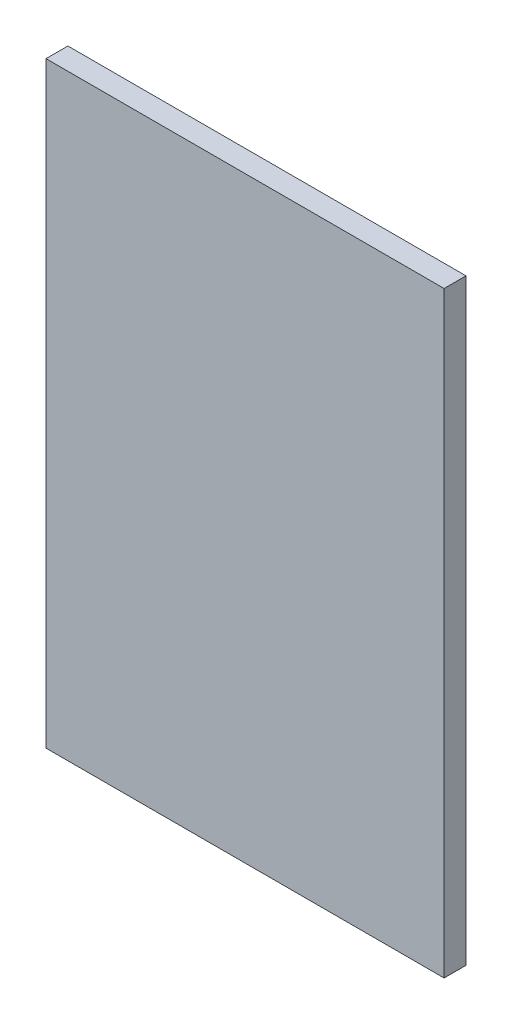
ISO-10303-21;
HEADER;
FILE_DESCRIPTION(('STEP AP214'),'2;1');
FILE_NAME('part.step','',(''),(''),'','','');
FILE_SCHEMA(('AUTOMOTIVE_DESIGN { 1 0 10303 214 1 1 1 1 }'));
ENDSEC;
DATA;
#1=APPLICATION_CONTEXT('core data for automotive mechanical design processes');
#2=APPLICATION_PROTOCOL_DEFINITION('international standard','automotive_design',2000,#1);
#3=PRODUCT_CONTEXT('',#1,'mechanical');
#4=PRODUCT('Part','Part','',(#3));
#5=PRODUCT_RELATED_PRODUCT_CATEGORY('part','',(#4));
#6=PRODUCT_DEFINITION_FORMATION('','',#4);
#7=PRODUCT_DEFINITION_CONTEXT('part definition',#1,'design');
#8=PRODUCT_DEFINITION('design','',#6,#7);
#9=PRODUCT_DEFINITION_SHAPE('','',#8);
#10=(LENGTH_UNIT() NAMED_UNIT(*) SI_UNIT(.MILLI.,.METRE.));
#11=(NAMED_UNIT(*) PLANE_ANGLE_UNIT() SI_UNIT($,.RADIAN.));
#12=(NAMED_UNIT(*) SI_UNIT($,.STERADIAN.) SOLID_ANGLE_UNIT());
#13=UNCERTAINTY_MEASURE_WITH_UNIT(LENGTH_MEASURE(1.E-05),#10,'distance_accuracy_value','');
#14=(GEOMETRIC_REPRESENTATION_CONTEXT(3) GLOBAL_UNCERTAINTY_ASSIGNED_CONTEXT((#13)) GLOBAL_UNIT_ASSIGNED_CONTEXT((#10,
#11,#12)) REPRESENTATION_CONTEXT('',''));
#15=CARTESIAN_POINT('',(0.,0.,0.));
#16=DIRECTION('',(0.,0.,1.));
#17=DIRECTION('',(1.,0.,0.));
#18=AXIS2_PLACEMENT_3D('',#15,#16,#17);
#19=CARTESIAN_POINT('',(10.,-15.,1.1));
#20=DIRECTION('',(-1.,0.,0.));
#21=DIRECTION('',(0.,0.,1.));
#22=AXIS2_PLACEMENT_3D('',#19,#20,#21);
#23=PLANE('',#22);
#24=DIRECTION('',(0.,1.,0.));
#25=VECTOR('',#24,1.);
#26=CARTESIAN_POINT('',(10.,-15.,0.));
#27=LINE('',#26,#25);
#28=CARTESIAN_POINT('',(10.,-15.,0.));
#29=VERTEX_POINT('',#28);
#30=CARTESIAN_POINT('',(10.,15.,0.));
#31=VERTEX_POINT('',#30);
#32=EDGE_CURVE('E96',#29,#31,#27,.T.);
#33=ORIENTED_EDGE('',*,*,#32,.T.);
#34=DIRECTION('',(0.,0.,-1.));
#35=VECTOR('',#34,1.);
#36=CARTESIAN_POINT('',(10.,15.,1.1));
#37=LINE('',#36,#35);
#38=CARTESIAN_POINT('',(10.,15.,1.1));
#39=VERTEX_POINT('',#38);
#40=EDGE_CURVE('E11',#39,#31,#37,.T.);
#41=ORIENTED_EDGE('',*,*,#40,.F.);
#42=DIRECTION('',(0.,1.,0.));
#43=VECTOR('',#42,1.);
#44=CARTESIAN_POINT('',(10.,-15.,1.1));
#45=LINE('',#44,#43);
#46=CARTESIAN_POINT('',(10.,-15.,1.1));
#47=VERTEX_POINT('',#46);
#48=EDGE_CURVE('E84',#47,#39,#45,.T.);
#49=ORIENTED_EDGE('',*,*,#48,.F.);
#50=DIRECTION('',(0.,0.,-1.));
#51=VECTOR('',#50,1.);
#52=CARTESIAN_POINT('',(10.,-15.,1.1));
#53=LINE('',#52,#51);
#54=EDGE_CURVE('E92',#47,#29,#53,.T.);
#55=ORIENTED_EDGE('',*,*,#54,.T.);
#56=EDGE_LOOP('',(#33,#41,#49,#55));
#57=FACE_BOUND('',#56,.T.);
#58=ADVANCED_FACE('F33',(#57),#23,.F.);
#59=CARTESIAN_POINT('',(-10.,15.,1.1));
#60=DIRECTION('',(0.,-1.,0.));
#61=DIRECTION('',(0.,0.,-1.));
#62=AXIS2_PLACEMENT_3D('',#59,#60,#61);
#63=PLANE('',#62);
#64=DIRECTION('',(-1.,0.,0.));
#65=VECTOR('',#64,1.);
#66=CARTESIAN_POINT('',(-10.,15.,0.));
#67=LINE('',#66,#65);
#68=CARTESIAN_POINT('',(-10.,15.,0.));
#69=VERTEX_POINT('',#68);
#70=EDGE_CURVE('E88',#31,#69,#67,.T.);
#71=ORIENTED_EDGE('',*,*,#70,.T.);
#72=DIRECTION('',(0.,0.,-1.));
#73=VECTOR('',#72,1.);
#74=CARTESIAN_POINT('',(-10.,15.,1.1));
#75=LINE('',#74,#73);
#76=CARTESIAN_POINT('',(-10.,15.,1.1));
#77=VERTEX_POINT('',#76);
#78=EDGE_CURVE('E41',#77,#69,#75,.T.);
#79=ORIENTED_EDGE('',*,*,#78,.F.);
#80=DIRECTION('',(-1.,0.,0.));
#81=VECTOR('',#80,1.);
#82=CARTESIAN_POINT('',(-10.,15.,1.1));
#83=LINE('',#82,#81);
#84=EDGE_CURVE('E79',#39,#77,#83,.T.);
#85=ORIENTED_EDGE('',*,*,#84,.F.);
#86=ORIENTED_EDGE('',*,*,#40,.T.);
#87=EDGE_LOOP('',(#71,#79,#85,#86));
#88=FACE_BOUND('',#87,.T.);
#89=ADVANCED_FACE('F87',(#88),#63,.F.);
#90=CARTESIAN_POINT('',(-10.,-15.,1.1));
#91=DIRECTION('',(1.,0.,0.));
#92=DIRECTION('',(0.,0.,-1.));
#93=AXIS2_PLACEMENT_3D('',#90,#91,#92);
#94=PLANE('',#93);
#95=DIRECTION('',(0.,-1.,0.));
#96=VECTOR('',#95,1.);
#97=CARTESIAN_POINT('',(-10.,-15.,0.));
#98=LINE('',#97,#96);
#99=CARTESIAN_POINT('',(-10.,-15.,0.));
#100=VERTEX_POINT('',#99);
#101=EDGE_CURVE('E66',#69,#100,#98,.T.);
#102=ORIENTED_EDGE('',*,*,#101,.T.);
#103=DIRECTION('',(0.,0.,-1.));
#104=VECTOR('',#103,1.);
#105=CARTESIAN_POINT('',(-10.,-15.,1.1));
#106=LINE('',#105,#104);
#107=CARTESIAN_POINT('',(-10.,-15.,1.1));
#108=VERTEX_POINT('',#107);
#109=EDGE_CURVE('E89',#108,#100,#106,.T.);
#110=ORIENTED_EDGE('',*,*,#109,.F.);
#111=DIRECTION('',(0.,-1.,0.));
#112=VECTOR('',#111,1.);
#113=CARTESIAN_POINT('',(-10.,-15.,1.1));
#114=LINE('',#113,#112);
#115=EDGE_CURVE('E82',#77,#108,#114,.T.);
#116=ORIENTED_EDGE('',*,*,#115,.F.);
#117=ORIENTED_EDGE('',*,*,#78,.T.);
#118=EDGE_LOOP('',(#102,#110,#116,#117));
#119=FACE_BOUND('',#118,.T.);
#120=ADVANCED_FACE('F90',(#119),#94,.F.);
#121=CARTESIAN_POINT('',(-10.,-15.,1.1));
#122=DIRECTION('',(0.,1.,0.));
#123=DIRECTION('',(0.,0.,1.));
#124=AXIS2_PLACEMENT_3D('',#121,#122,#123);
#125=PLANE('',#124);
#126=DIRECTION('',(1.,0.,0.));
#127=VECTOR('',#126,1.);
#128=CARTESIAN_POINT('',(-10.,-15.,0.));
#129=LINE('',#128,#127);
#130=EDGE_CURVE('E72',#100,#29,#129,.T.);
#131=ORIENTED_EDGE('',*,*,#130,.T.);
#132=ORIENTED_EDGE('',*,*,#54,.F.);
#133=DIRECTION('',(1.,0.,0.));
#134=VECTOR('',#133,1.);
#135=CARTESIAN_POINT('',(-10.,-15.,1.1));
#136=LINE('',#135,#134);
#137=EDGE_CURVE('E49',#108,#47,#136,.T.);
#138=ORIENTED_EDGE('',*,*,#137,.F.);
#139=ORIENTED_EDGE('',*,*,#109,.T.);
#140=EDGE_LOOP('',(#131,#132,#138,#139));
#141=FACE_BOUND('',#140,.T.);
#142=ADVANCED_FACE('F103',(#141),#125,.F.);
#143=CARTESIAN_POINT('',(0.,0.,1.1));
#144=DIRECTION('',(0.,0.,-1.));
#145=DIRECTION('',(-1.,0.,0.));
#146=AXIS2_PLACEMENT_3D('',#143,#144,#145);
#147=PLANE('',#146);
#148=ORIENTED_EDGE('',*,*,#48,.T.);
#149=ORIENTED_EDGE('',*,*,#84,.T.);
#150=ORIENTED_EDGE('',*,*,#115,.T.);
#151=ORIENTED_EDGE('',*,*,#137,.T.);
#152=EDGE_LOOP('',(#148,#149,#150,#151));
#153=FACE_BOUND('',#152,.T.);
#154=ADVANCED_FACE('F80',(#153),#147,.F.);
#155=CARTESIAN_POINT('',(0.,0.,0.));
#156=DIRECTION('',(0.,0.,-1.));
#157=DIRECTION('',(-1.,0.,0.));
#158=AXIS2_PLACEMENT_3D('',#155,#156,#157);
#159=PLANE('',#158);
#160=ORIENTED_EDGE('',*,*,#32,.F.);
#161=ORIENTED_EDGE('',*,*,#130,.F.);
#162=ORIENTED_EDGE('',*,*,#101,.F.);
#163=ORIENTED_EDGE('',*,*,#70,.F.);
#164=EDGE_LOOP('',(#160,#161,#162,#163));
#165=FACE_BOUND('',#164,.T.);
#166=ADVANCED_FACE('F106',(#165),#159,.T.);
#167=CLOSED_SHELL('',(#58,#89,#120,#142,#154,#166));
#168=MANIFOLD_SOLID_BREP('B2',#167);
#169=ADVANCED_BREP_SHAPE_REPRESENTATION('',(#18,#168),#14);
#170=SHAPE_DEFINITION_REPRESENTATION(#9,#169);
ENDSEC;
END-ISO-10303-21;
